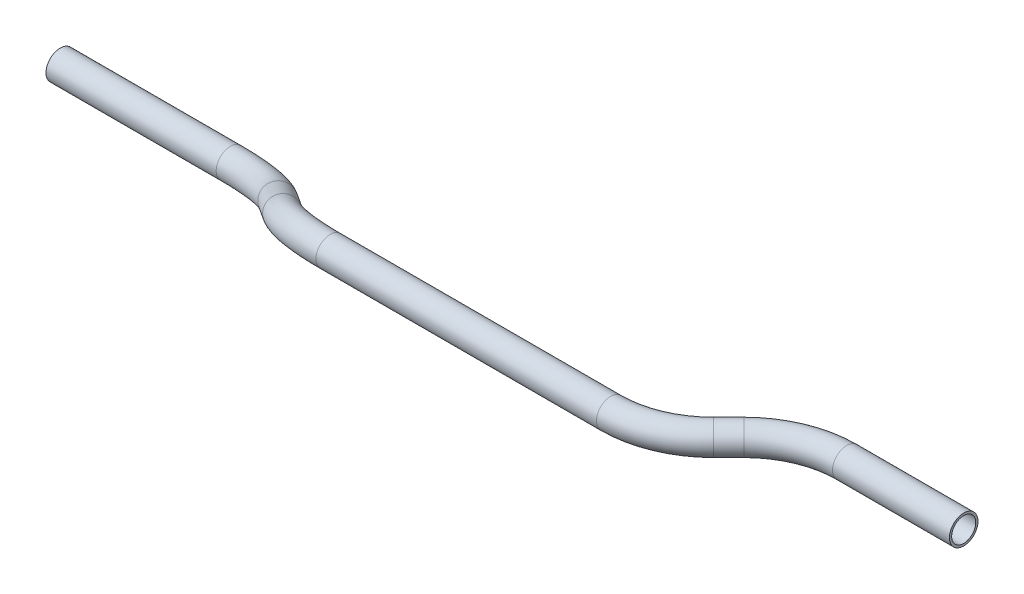
ISO-10303-21;
HEADER;
FILE_DESCRIPTION(('STEP AP214'),'2;1');
FILE_NAME('part.step','',(''),(''),'','','');
FILE_SCHEMA(('AUTOMOTIVE_DESIGN { 1 0 10303 214 1 1 1 1 }'));
ENDSEC;
DATA;
#1=APPLICATION_CONTEXT('core data for automotive mechanical design processes');
#2=APPLICATION_PROTOCOL_DEFINITION('international standard','automotive_design',2000,#1);
#3=PRODUCT_CONTEXT('',#1,'mechanical');
#4=PRODUCT('Part','Part','',(#3));
#5=PRODUCT_RELATED_PRODUCT_CATEGORY('part','',(#4));
#6=PRODUCT_DEFINITION_FORMATION('','',#4);
#7=PRODUCT_DEFINITION_CONTEXT('part definition',#1,'design');
#8=PRODUCT_DEFINITION('design','',#6,#7);
#9=PRODUCT_DEFINITION_SHAPE('','',#8);
#10=(LENGTH_UNIT() NAMED_UNIT(*) SI_UNIT(.MILLI.,.METRE.));
#11=(NAMED_UNIT(*) PLANE_ANGLE_UNIT() SI_UNIT($,.RADIAN.));
#12=(NAMED_UNIT(*) SI_UNIT($,.STERADIAN.) SOLID_ANGLE_UNIT());
#13=UNCERTAINTY_MEASURE_WITH_UNIT(LENGTH_MEASURE(1.E-05),#10,'distance_accuracy_value','');
#14=(GEOMETRIC_REPRESENTATION_CONTEXT(3) GLOBAL_UNCERTAINTY_ASSIGNED_CONTEXT((#13)) GLOBAL_UNIT_ASSIGNED_CONTEXT((#10,
#11,#12)) REPRESENTATION_CONTEXT('',''));
#15=CARTESIAN_POINT('',(0.,0.,0.));
#16=DIRECTION('',(0.,0.,1.));
#17=DIRECTION('',(1.,0.,0.));
#18=AXIS2_PLACEMENT_3D('',#15,#16,#17);
#19=CARTESIAN_POINT('',(0.,0.,0.));
#20=DIRECTION('',(1.,0.,0.));
#21=DIRECTION('',(0.,0.,-1.));
#22=AXIS2_PLACEMENT_3D('',#19,#20,#21);
#23=CYLINDRICAL_SURFACE('',#22,7.9375);
#24=CARTESIAN_POINT('',(94.5663525143776,0.,0.));
#25=DIRECTION('',(1.,0.,0.));
#26=DIRECTION('',(0.,0.,-1.));
#27=AXIS2_PLACEMENT_3D('',#24,#25,#26);
#28=CIRCLE('',#27,7.9375);
#29=CARTESIAN_POINT('',(94.5663525143776,-4.32718782370299,-6.65427319760743));
#30=VERTEX_POINT('',#29);
#31=EDGE_CURVE('E57',#30,#30,#28,.T.);
#32=ORIENTED_EDGE('',*,*,#31,.F.);
#33=EDGE_LOOP('',(#32));
#34=FACE_BOUND('',#33,.T.);
#35=CARTESIAN_POINT('',(0.,0.,0.));
#36=DIRECTION('',(1.,0.,0.));
#37=DIRECTION('',(0.,0.,-1.));
#38=AXIS2_PLACEMENT_3D('',#35,#36,#37);
#39=CIRCLE('',#38,7.9375);
#40=CARTESIAN_POINT('',(0.,0.,-7.9375));
#41=VERTEX_POINT('',#40);
#42=EDGE_CURVE('E54',#41,#41,#39,.T.);
#43=ORIENTED_EDGE('',*,*,#42,.T.);
#44=EDGE_LOOP('',(#43));
#45=FACE_BOUND('',#44,.T.);
#46=ADVANCED_FACE('F33',(#34,#45),#23,.T.);
#47=CARTESIAN_POINT('',(94.5663525143776,31.1557523306615,47.9107670227735));
#48=DIRECTION('',(0.,-0.838333631194637,0.54515752109644));
#49=DIRECTION('',(0.,-0.54515752109644,-0.838333631194637));
#50=AXIS2_PLACEMENT_3D('',#47,#48,#49);
#51=TOROIDAL_SURFACE('',#50,57.15,7.9375);
#52=CARTESIAN_POINT('',(134.977505059189,9.12530858468219,14.0327387691215));
#53=DIRECTION('',(0.707106781186547,0.385484579982141,0.59279139551447));
#54=DIRECTION('',(0.59279139551447,0.133859196527878,-0.794153685950596));
#55=AXIS2_PLACEMENT_3D('',#52,#53,#54);
#56=CIRCLE('',#55,7.9375);
#57=CARTESIAN_POINT('',(140.590165134857,6.06552473107395,9.32745706722543));
#58=VERTEX_POINT('',#57);
#59=EDGE_CURVE('E60',#58,#58,#56,.T.);
#60=CARTESIAN_POINT('',(94.5663525143776,31.1557523306615,47.9107670227735));
#61=DIRECTION('',(0.,-0.838333631194637,0.54515752109644));
#62=DIRECTION('',(0.,-0.54515752109644,-0.838333631194637));
#63=AXIS2_PLACEMENT_3D('',#60,#61,#62);
#64=CIRCLE('',#63,65.0875);
#65=EDGE_CURVE('',#30,#58,#64,.T.);
#66=ORIENTED_EDGE('',*,*,#31,.T.);
#67=ORIENTED_EDGE('',*,*,#59,.F.);
#68=ORIENTED_EDGE('',*,*,#65,.T.);
#69=ORIENTED_EDGE('',*,*,#65,.F.);
#70=EDGE_LOOP('',(#66,#68,#67,#69));
#71=FACE_BOUND('',#70,.T.);
#72=ADVANCED_FACE('F117',(#71),#51,.T.);
#73=CARTESIAN_POINT('',(134.977505059189,9.12530858468218,14.0327387691215));
#74=DIRECTION('',(0.707106781186547,0.385484579982141,0.59279139551447));
#75=DIRECTION('',(0.642443072279212,0.,-0.766333412347685));
#76=AXIS2_PLACEMENT_3D('',#73,#74,#75);
#77=CYLINDRICAL_SURFACE('',#76,7.9375);
#78=CARTESIAN_POINT('',(151.491840100273,18.1282225382357,27.8772612308785));
#79=DIRECTION('',(0.707106781186547,0.385484579982141,0.59279139551447));
#80=DIRECTION('',(0.59279139551447,0.133859196527878,-0.794153685950596));
#81=AXIS2_PLACEMENT_3D('',#78,#79,#80);
#82=CIRCLE('',#81,7.9375);
#83=CARTESIAN_POINT('',(145.879180024605,21.188006391844,32.5825429327746));
#84=VERTEX_POINT('',#83);
#85=EDGE_CURVE('E63',#84,#84,#82,.T.);
#86=ORIENTED_EDGE('',*,*,#85,.F.);
#87=EDGE_LOOP('',(#86));
#88=FACE_BOUND('',#87,.T.);
#89=ORIENTED_EDGE('',*,*,#59,.T.);
#90=EDGE_LOOP('',(#89));
#91=FACE_BOUND('',#90,.T.);
#92=ADVANCED_FACE('F121',(#88,#91),#77,.T.);
#93=CARTESIAN_POINT('',(191.902992645084,-3.90222120774364,-6.00076702277346));
#94=DIRECTION('',(0.,0.838333631194636,-0.54515752109644));
#95=DIRECTION('',(0.,0.54515752109644,0.838333631194636));
#96=AXIS2_PLACEMENT_3D('',#93,#94,#95);
#97=TOROIDAL_SURFACE('',#96,57.15,7.9375);
#98=CARTESIAN_POINT('',(191.902992645084,27.2535311229179,41.91));
#99=DIRECTION('',(1.,0.,0.));
#100=DIRECTION('',(0.,0.,-1.));
#101=AXIS2_PLACEMENT_3D('',#98,#99,#100);
#102=CIRCLE('',#101,7.9375);
#103=CARTESIAN_POINT('',(191.902992645084,31.5807189466209,48.5642731976074));
#104=VERTEX_POINT('',#103);
#105=EDGE_CURVE('E66',#104,#104,#102,.T.);
#106=CARTESIAN_POINT('',(191.902992645084,-3.90222120774364,-6.00076702277346));
#107=DIRECTION('',(0.,0.838333631194636,-0.54515752109644));
#108=DIRECTION('',(0.,0.54515752109644,0.838333631194636));
#109=AXIS2_PLACEMENT_3D('',#106,#107,#108);
#110=CIRCLE('',#109,65.0875);
#111=EDGE_CURVE('',#84,#104,#110,.T.);
#112=ORIENTED_EDGE('',*,*,#85,.T.);
#113=ORIENTED_EDGE('',*,*,#105,.F.);
#114=ORIENTED_EDGE('',*,*,#111,.T.);
#115=ORIENTED_EDGE('',*,*,#111,.F.);
#116=EDGE_LOOP('',(#112,#114,#113,#115));
#117=FACE_BOUND('',#116,.T.);
#118=ADVANCED_FACE('F125',(#117),#97,.T.);
#119=CARTESIAN_POINT('',(191.902992645084,27.2535311229179,41.91));
#120=DIRECTION('',(1.,0.,0.));
#121=DIRECTION('',(0.,1.,0.));
#122=AXIS2_PLACEMENT_3D('',#119,#120,#121);
#123=CYLINDRICAL_SURFACE('',#122,7.9375);
#124=CARTESIAN_POINT('',(347.758382465839,27.2535311229179,41.91));
#125=DIRECTION('',(1.,0.,0.));
#126=DIRECTION('',(0.,0.,-1.));
#127=AXIS2_PLACEMENT_3D('',#124,#125,#126);
#128=CIRCLE('',#127,7.9375);
#129=CARTESIAN_POINT('',(347.758382465839,27.2535311229178,49.8475));
#130=VERTEX_POINT('',#129);
#131=EDGE_CURVE('E69',#130,#130,#128,.T.);
#132=ORIENTED_EDGE('',*,*,#131,.F.);
#133=EDGE_LOOP('',(#132));
#134=FACE_BOUND('',#133,.T.);
#135=ORIENTED_EDGE('',*,*,#105,.T.);
#136=EDGE_LOOP('',(#135));
#137=FACE_BOUND('',#136,.T.);
#138=ADVANCED_FACE('F129',(#134,#137),#123,.T.);
#139=CARTESIAN_POINT('',(347.758382465839,27.2535311229182,-15.24));
#140=DIRECTION('',(0.,1.,0.));
#141=DIRECTION('',(0.,0.,1.));
#142=AXIS2_PLACEMENT_3D('',#139,#140,#141);
#143=TOROIDAL_SURFACE('',#142,57.15,7.9375);
#144=CARTESIAN_POINT('',(388.169535010651,27.2535311229182,25.171152544811));
#145=DIRECTION('',(0.707106781186545,0.,-0.70710678118655));
#146=DIRECTION('',(-0.707106781186551,0.,-0.707106781186545));
#147=AXIS2_PLACEMENT_3D('',#144,#145,#146);
#148=CIRCLE('',#147,7.9375);
#149=CARTESIAN_POINT('',(393.782195086319,27.2535311229182,30.7838126204792));
#150=VERTEX_POINT('',#149);
#151=EDGE_CURVE('E72',#150,#150,#148,.T.);
#152=CARTESIAN_POINT('',(347.758382465839,27.2535311229182,-15.24));
#153=DIRECTION('',(0.,1.,0.));
#154=DIRECTION('',(0.,0.,1.));
#155=AXIS2_PLACEMENT_3D('',#152,#153,#154);
#156=CIRCLE('',#155,65.0875);
#157=EDGE_CURVE('',#130,#150,#156,.T.);
#158=ORIENTED_EDGE('',*,*,#131,.T.);
#159=ORIENTED_EDGE('',*,*,#151,.F.);
#160=ORIENTED_EDGE('',*,*,#157,.T.);
#161=ORIENTED_EDGE('',*,*,#157,.F.);
#162=EDGE_LOOP('',(#158,#160,#159,#161));
#163=FACE_BOUND('',#162,.T.);
#164=ADVANCED_FACE('F91',(#163),#143,.T.);
#165=CARTESIAN_POINT('',(388.169535010651,27.253531122918,25.171152544811));
#166=DIRECTION('',(0.707106781186545,0.,-0.70710678118655));
#167=DIRECTION('',(-0.70710678118655,0.,-0.707106781186545));
#168=AXIS2_PLACEMENT_3D('',#165,#166,#167);
#169=CYLINDRICAL_SURFACE('',#168,7.9375);
#170=CARTESIAN_POINT('',(396.601840100272,27.253531122918,16.7388474551892));
#171=DIRECTION('',(0.707106781186545,0.,-0.70710678118655));
#172=DIRECTION('',(-0.70710678118655,0.,-0.707106781186545));
#173=AXIS2_PLACEMENT_3D('',#170,#171,#172);
#174=CIRCLE('',#173,7.9375);
#175=CARTESIAN_POINT('',(390.989180024604,27.253531122918,11.126187379521));
#176=VERTEX_POINT('',#175);
#177=EDGE_CURVE('E74',#176,#176,#174,.T.);
#178=ORIENTED_EDGE('',*,*,#177,.F.);
#179=EDGE_LOOP('',(#178));
#180=FACE_BOUND('',#179,.T.);
#181=ORIENTED_EDGE('',*,*,#151,.T.);
#182=EDGE_LOOP('',(#181));
#183=FACE_BOUND('',#182,.T.);
#184=ADVANCED_FACE('F84',(#180,#183),#169,.T.);
#185=CARTESIAN_POINT('',(437.012992645084,27.2535311229181,57.1500000000002));
#186=DIRECTION('',(0.,-1.,0.));
#187=DIRECTION('',(0.,0.,-1.));
#188=AXIS2_PLACEMENT_3D('',#185,#186,#187);
#189=TOROIDAL_SURFACE('',#188,57.15,7.9375);
#190=CARTESIAN_POINT('',(437.012992645084,27.2535311229181,1.94289029309402E-13));
#191=DIRECTION('',(1.,0.,0.));
#192=DIRECTION('',(0.,0.,-1.));
#193=AXIS2_PLACEMENT_3D('',#190,#191,#192);
#194=CIRCLE('',#193,7.9375);
#195=CARTESIAN_POINT('',(437.012992645084,27.2535311229181,-7.93749999999981));
#196=VERTEX_POINT('',#195);
#197=EDGE_CURVE('E37',#196,#196,#194,.T.);
#198=CARTESIAN_POINT('',(437.012992645084,27.2535311229181,57.1500000000002));
#199=DIRECTION('',(0.,-1.,0.));
#200=DIRECTION('',(0.,0.,-1.));
#201=AXIS2_PLACEMENT_3D('',#198,#199,#200);
#202=CIRCLE('',#201,65.0875);
#203=EDGE_CURVE('',#176,#196,#202,.T.);
#204=ORIENTED_EDGE('',*,*,#177,.T.);
#205=ORIENTED_EDGE('',*,*,#197,.F.);
#206=ORIENTED_EDGE('',*,*,#203,.T.);
#207=ORIENTED_EDGE('',*,*,#203,.F.);
#208=EDGE_LOOP('',(#204,#206,#205,#207));
#209=FACE_BOUND('',#208,.T.);
#210=ADVANCED_FACE('F82',(#209),#189,.T.);
#211=CARTESIAN_POINT('',(437.012992645084,27.2535311229182,1.86519884467192E-13));
#212=DIRECTION('',(1.,0.,0.));
#213=DIRECTION('',(0.,1.,0.));
#214=AXIS2_PLACEMENT_3D('',#211,#212,#213);
#215=CYLINDRICAL_SURFACE('',#214,7.9375);
#216=CARTESIAN_POINT('',(501.994161759461,27.2535311229185,2.25405631659736E-13));
#217=DIRECTION('',(1.,0.,0.));
#218=DIRECTION('',(0.,0.,-1.));
#219=AXIS2_PLACEMENT_3D('',#216,#217,#218);
#220=CIRCLE('',#219,7.9375);
#221=CARTESIAN_POINT('',(501.994161759461,27.2535311229185,-7.93749999999977));
#222=VERTEX_POINT('',#221);
#223=EDGE_CURVE('E50',#222,#222,#220,.T.);
#224=ORIENTED_EDGE('',*,*,#223,.F.);
#225=EDGE_LOOP('',(#224));
#226=FACE_BOUND('',#225,.T.);
#227=ORIENTED_EDGE('',*,*,#197,.T.);
#228=EDGE_LOOP('',(#227));
#229=FACE_BOUND('',#228,.T.);
#230=ADVANCED_FACE('F35',(#226,#229),#215,.T.);
#231=CARTESIAN_POINT('',(0.,0.,0.));
#232=DIRECTION('',(1.,0.,0.));
#233=DIRECTION('',(0.,0.,-1.));
#234=AXIS2_PLACEMENT_3D('',#231,#232,#233);
#235=PLANE('',#234);
#236=CARTESIAN_POINT('',(0.,0.,0.));
#237=DIRECTION('',(1.,0.,0.));
#238=DIRECTION('',(0.,0.,-1.));
#239=AXIS2_PLACEMENT_3D('',#236,#237,#238);
#240=CIRCLE('',#239,6.6929);
#241=CARTESIAN_POINT('',(0.,0.,-6.6929));
#242=VERTEX_POINT('',#241);
#243=EDGE_CURVE('E53',#242,#242,#240,.F.);
#244=ORIENTED_EDGE('',*,*,#243,.F.);
#245=EDGE_LOOP('',(#244));
#246=FACE_BOUND('',#245,.T.);
#247=ORIENTED_EDGE('',*,*,#42,.F.);
#248=EDGE_LOOP('',(#247));
#249=FACE_BOUND('',#248,.T.);
#250=ADVANCED_FACE('F89',(#246,#249),#235,.F.);
#251=CARTESIAN_POINT('',(501.994161759461,27.2535311229185,2.25405631659736E-13));
#252=DIRECTION('',(1.,0.,0.));
#253=DIRECTION('',(0.,0.,-1.));
#254=AXIS2_PLACEMENT_3D('',#251,#252,#253);
#255=PLANE('',#254);
#256=CARTESIAN_POINT('',(501.994161759461,27.2535311229185,2.25405631659736E-13));
#257=DIRECTION('',(1.,0.,0.));
#258=DIRECTION('',(0.,0.,-1.));
#259=AXIS2_PLACEMENT_3D('',#256,#257,#258);
#260=CIRCLE('',#259,6.6929);
#261=CARTESIAN_POINT('',(501.994161759461,27.2535311229185,-6.69289999999977));
#262=VERTEX_POINT('',#261);
#263=EDGE_CURVE('E10',#262,#262,#260,.F.);
#264=ORIENTED_EDGE('',*,*,#263,.T.);
#265=EDGE_LOOP('',(#264));
#266=FACE_BOUND('',#265,.T.);
#267=ORIENTED_EDGE('',*,*,#223,.T.);
#268=EDGE_LOOP('',(#267));
#269=FACE_BOUND('',#268,.T.);
#270=ADVANCED_FACE('F108',(#266,#269),#255,.T.);
#271=CARTESIAN_POINT('',(0.,0.,0.));
#272=DIRECTION('',(1.,0.,0.));
#273=DIRECTION('',(0.,0.,-1.));
#274=AXIS2_PLACEMENT_3D('',#271,#272,#273);
#275=CYLINDRICAL_SURFACE('',#274,6.6929);
#276=CARTESIAN_POINT('',(94.5663525143776,0.,0.));
#277=DIRECTION('',(1.,0.,0.));
#278=DIRECTION('',(0.,0.,-1.));
#279=AXIS2_PLACEMENT_3D('',#276,#277,#278);
#280=CIRCLE('',#279,6.6929);
#281=CARTESIAN_POINT('',(94.5663525143776,-3.64868477294637,-5.61088316022259));
#282=VERTEX_POINT('',#281);
#283=EDGE_CURVE('E282',#282,#282,#280,.F.);
#284=ORIENTED_EDGE('',*,*,#283,.F.);
#285=EDGE_LOOP('',(#284));
#286=FACE_BOUND('',#285,.T.);
#287=ORIENTED_EDGE('',*,*,#243,.T.);
#288=EDGE_LOOP('',(#287));
#289=FACE_BOUND('',#288,.T.);
#290=ADVANCED_FACE('F111',(#286,#289),#275,.F.);
#291=CARTESIAN_POINT('',(94.5663525143776,31.1557523306615,47.9107670227735));
#292=DIRECTION('',(0.,-0.838333631194637,0.54515752109644));
#293=DIRECTION('',(0.,-0.54515752109644,-0.838333631194637));
#294=AXIS2_PLACEMENT_3D('',#291,#292,#293);
#295=TOROIDAL_SURFACE('',#294,57.15,6.6929);
#296=CARTESIAN_POINT('',(134.977505059189,9.12530858468219,14.0327387691215));
#297=DIRECTION('',(0.707106781186547,0.385484579982141,0.59279139551447));
#298=DIRECTION('',(0.59279139551447,0.133859196527878,-0.794153685950596));
#299=AXIS2_PLACEMENT_3D('',#296,#297,#298);
#300=CIRCLE('',#299,6.6929);
#301=CARTESIAN_POINT('',(139.710100034992,6.54529883931972,10.0652452380827));
#302=VERTEX_POINT('',#301);
#303=EDGE_CURVE('E279',#302,#302,#300,.F.);
#304=CARTESIAN_POINT('',(94.5663525143776,31.1557523306615,47.9107670227735));
#305=DIRECTION('',(0.,-0.838333631194637,0.54515752109644));
#306=DIRECTION('',(0.,-0.54515752109644,-0.838333631194637));
#307=AXIS2_PLACEMENT_3D('',#304,#305,#306);
#308=CIRCLE('',#307,63.8429);
#309=EDGE_CURVE('',#282,#302,#308,.T.);
#310=ORIENTED_EDGE('',*,*,#283,.T.);
#311=ORIENTED_EDGE('',*,*,#303,.F.);
#312=ORIENTED_EDGE('',*,*,#309,.T.);
#313=ORIENTED_EDGE('',*,*,#309,.F.);
#314=EDGE_LOOP('',(#310,#312,#311,#313));
#315=FACE_BOUND('',#314,.T.);
#316=ADVANCED_FACE('F190',(#315),#295,.F.);
#317=CARTESIAN_POINT('',(134.977505059189,9.12530858468218,14.0327387691215));
#318=DIRECTION('',(0.707106781186547,0.385484579982141,0.59279139551447));
#319=DIRECTION('',(0.642443072279212,0.,-0.766333412347685));
#320=AXIS2_PLACEMENT_3D('',#317,#318,#319);
#321=CYLINDRICAL_SURFACE('',#320,6.6929);
#322=CARTESIAN_POINT('',(151.491840100273,18.1282225382357,27.8772612308785));
#323=DIRECTION('',(0.707106781186547,0.385484579982141,0.59279139551447));
#324=DIRECTION('',(0.59279139551447,0.133859196527878,-0.794153685950596));
#325=AXIS2_PLACEMENT_3D('',#322,#323,#324);
#326=CIRCLE('',#325,6.6929);
#327=CARTESIAN_POINT('',(146.759245124469,20.7082322835982,31.8447547619173));
#328=VERTEX_POINT('',#327);
#329=EDGE_CURVE('E276',#328,#328,#326,.F.);
#330=ORIENTED_EDGE('',*,*,#329,.F.);
#331=EDGE_LOOP('',(#330));
#332=FACE_BOUND('',#331,.T.);
#333=ORIENTED_EDGE('',*,*,#303,.T.);
#334=EDGE_LOOP('',(#333));
#335=FACE_BOUND('',#334,.T.);
#336=ADVANCED_FACE('F200',(#332,#335),#321,.F.);
#337=CARTESIAN_POINT('',(191.902992645084,-3.90222120774364,-6.00076702277346));
#338=DIRECTION('',(0.,0.838333631194636,-0.54515752109644));
#339=DIRECTION('',(0.,0.54515752109644,0.838333631194636));
#340=AXIS2_PLACEMENT_3D('',#337,#338,#339);
#341=TOROIDAL_SURFACE('',#340,57.15,6.6929);
#342=CARTESIAN_POINT('',(191.902992645084,27.2535311229179,41.91));
#343=DIRECTION('',(1.,0.,0.));
#344=DIRECTION('',(0.,0.,-1.));
#345=AXIS2_PLACEMENT_3D('',#342,#343,#344);
#346=CIRCLE('',#345,6.6929);
#347=CARTESIAN_POINT('',(191.902992645084,30.9022158958643,47.5208831602226));
#348=VERTEX_POINT('',#347);
#349=EDGE_CURVE('E271',#348,#348,#346,.F.);
#350=CARTESIAN_POINT('',(191.902992645084,-3.90222120774364,-6.00076702277346));
#351=DIRECTION('',(0.,0.838333631194636,-0.54515752109644));
#352=DIRECTION('',(0.,0.54515752109644,0.838333631194636));
#353=AXIS2_PLACEMENT_3D('',#350,#351,#352);
#354=CIRCLE('',#353,63.8429);
#355=EDGE_CURVE('',#328,#348,#354,.T.);
#356=ORIENTED_EDGE('',*,*,#329,.T.);
#357=ORIENTED_EDGE('',*,*,#349,.F.);
#358=ORIENTED_EDGE('',*,*,#355,.T.);
#359=ORIENTED_EDGE('',*,*,#355,.F.);
#360=EDGE_LOOP('',(#356,#358,#357,#359));
#361=FACE_BOUND('',#360,.T.);
#362=ADVANCED_FACE('F210',(#361),#341,.F.);
#363=CARTESIAN_POINT('',(191.902992645084,27.2535311229179,41.91));
#364=DIRECTION('',(1.,0.,0.));
#365=DIRECTION('',(0.,1.,0.));
#366=AXIS2_PLACEMENT_3D('',#363,#364,#365);
#367=CYLINDRICAL_SURFACE('',#366,6.6929);
#368=CARTESIAN_POINT('',(347.758382465839,27.2535311229179,41.91));
#369=DIRECTION('',(1.,0.,0.));
#370=DIRECTION('',(0.,0.,-1.));
#371=AXIS2_PLACEMENT_3D('',#368,#369,#370);
#372=CIRCLE('',#371,6.6929);
#373=CARTESIAN_POINT('',(347.758382465839,27.2535311229179,48.6029));
#374=VERTEX_POINT('',#373);
#375=EDGE_CURVE('E268',#374,#374,#372,.F.);
#376=ORIENTED_EDGE('',*,*,#375,.F.);
#377=EDGE_LOOP('',(#376));
#378=FACE_BOUND('',#377,.T.);
#379=ORIENTED_EDGE('',*,*,#349,.T.);
#380=EDGE_LOOP('',(#379));
#381=FACE_BOUND('',#380,.T.);
#382=ADVANCED_FACE('F220',(#378,#381),#367,.F.);
#383=CARTESIAN_POINT('',(347.758382465839,27.2535311229182,-15.24));
#384=DIRECTION('',(0.,1.,0.));
#385=DIRECTION('',(0.,0.,1.));
#386=AXIS2_PLACEMENT_3D('',#383,#384,#385);
#387=TOROIDAL_SURFACE('',#386,57.15,6.6929);
#388=CARTESIAN_POINT('',(388.169535010651,27.2535311229182,25.171152544811));
#389=DIRECTION('',(0.707106781186545,0.,-0.70710678118655));
#390=DIRECTION('',(-0.707106781186551,0.,-0.707106781186545));
#391=AXIS2_PLACEMENT_3D('',#388,#389,#390);
#392=CIRCLE('',#391,6.6929);
#393=CARTESIAN_POINT('',(392.902129986454,27.2535311229182,29.9037475206145));
#394=VERTEX_POINT('',#393);
#395=EDGE_CURVE('E267',#394,#394,#392,.F.);
#396=CARTESIAN_POINT('',(347.758382465839,27.2535311229182,-15.24));
#397=DIRECTION('',(0.,1.,0.));
#398=DIRECTION('',(0.,0.,1.));
#399=AXIS2_PLACEMENT_3D('',#396,#397,#398);
#400=CIRCLE('',#399,63.8429);
#401=EDGE_CURVE('',#374,#394,#400,.T.);
#402=ORIENTED_EDGE('',*,*,#375,.T.);
#403=ORIENTED_EDGE('',*,*,#395,.F.);
#404=ORIENTED_EDGE('',*,*,#401,.T.);
#405=ORIENTED_EDGE('',*,*,#401,.F.);
#406=EDGE_LOOP('',(#402,#404,#403,#405));
#407=FACE_BOUND('',#406,.T.);
#408=ADVANCED_FACE('F230',(#407),#387,.F.);
#409=CARTESIAN_POINT('',(388.169535010651,27.253531122918,25.171152544811));
#410=DIRECTION('',(0.707106781186545,0.,-0.70710678118655));
#411=DIRECTION('',(-0.70710678118655,0.,-0.707106781186545));
#412=AXIS2_PLACEMENT_3D('',#409,#410,#411);
#413=CYLINDRICAL_SURFACE('',#412,6.6929);
#414=CARTESIAN_POINT('',(396.601840100272,27.253531122918,16.7388474551892));
#415=DIRECTION('',(0.707106781186545,0.,-0.70710678118655));
#416=DIRECTION('',(-0.70710678118655,0.,-0.707106781186545));
#417=AXIS2_PLACEMENT_3D('',#414,#415,#416);
#418=CIRCLE('',#417,6.6929);
#419=CARTESIAN_POINT('',(391.869245124469,27.253531122918,12.0062524793858));
#420=VERTEX_POINT('',#419);
#421=EDGE_CURVE('E46',#420,#420,#418,.F.);
#422=ORIENTED_EDGE('',*,*,#421,.F.);
#423=EDGE_LOOP('',(#422));
#424=FACE_BOUND('',#423,.T.);
#425=ORIENTED_EDGE('',*,*,#395,.T.);
#426=EDGE_LOOP('',(#425));
#427=FACE_BOUND('',#426,.T.);
#428=ADVANCED_FACE('F102',(#424,#427),#413,.F.);
#429=CARTESIAN_POINT('',(437.012992645084,27.2535311229181,57.1500000000002));
#430=DIRECTION('',(0.,-1.,0.));
#431=DIRECTION('',(0.,0.,-1.));
#432=AXIS2_PLACEMENT_3D('',#429,#430,#431);
#433=TOROIDAL_SURFACE('',#432,57.15,6.6929);
#434=CARTESIAN_POINT('',(437.012992645084,27.2535311229181,1.94289029309402E-13));
#435=DIRECTION('',(1.,0.,0.));
#436=DIRECTION('',(0.,0.,-1.));
#437=AXIS2_PLACEMENT_3D('',#434,#435,#436);
#438=CIRCLE('',#437,6.6929);
#439=CARTESIAN_POINT('',(437.012992645084,27.2535311229181,-6.69289999999979));
#440=VERTEX_POINT('',#439);
#441=EDGE_CURVE('E41',#440,#440,#438,.F.);
#442=CARTESIAN_POINT('',(437.012992645084,27.2535311229181,57.1500000000002));
#443=DIRECTION('',(0.,-1.,0.));
#444=DIRECTION('',(0.,0.,-1.));
#445=AXIS2_PLACEMENT_3D('',#442,#443,#444);
#446=CIRCLE('',#445,63.8429);
#447=EDGE_CURVE('',#420,#440,#446,.T.);
#448=ORIENTED_EDGE('',*,*,#421,.T.);
#449=ORIENTED_EDGE('',*,*,#441,.F.);
#450=ORIENTED_EDGE('',*,*,#447,.T.);
#451=ORIENTED_EDGE('',*,*,#447,.F.);
#452=EDGE_LOOP('',(#448,#450,#449,#451));
#453=FACE_BOUND('',#452,.T.);
#454=ADVANCED_FACE('F96',(#453),#433,.F.);
#455=CARTESIAN_POINT('',(437.012992645084,27.2535311229182,1.86519884467192E-13));
#456=DIRECTION('',(1.,0.,0.));
#457=DIRECTION('',(0.,1.,0.));
#458=AXIS2_PLACEMENT_3D('',#455,#456,#457);
#459=CYLINDRICAL_SURFACE('',#458,6.6929);
#460=ORIENTED_EDGE('',*,*,#263,.F.);
#461=EDGE_LOOP('',(#460));
#462=FACE_BOUND('',#461,.T.);
#463=ORIENTED_EDGE('',*,*,#441,.T.);
#464=EDGE_LOOP('',(#463));
#465=FACE_BOUND('',#464,.T.);
#466=ADVANCED_FACE('F94',(#462,#465),#459,.F.);
#467=CLOSED_SHELL('',(#46,#72,#92,#118,#138,#164,#184,#210,#230,#250,#270,#290,#316,#336,#362,
#382,#408,#428,#454,#466));
#468=MANIFOLD_SOLID_BREP('B2',#467);
#469=ADVANCED_BREP_SHAPE_REPRESENTATION('',(#18,#468),#14);
#470=SHAPE_DEFINITION_REPRESENTATION(#9,#469);
ENDSEC;
END-ISO-10303-21;
